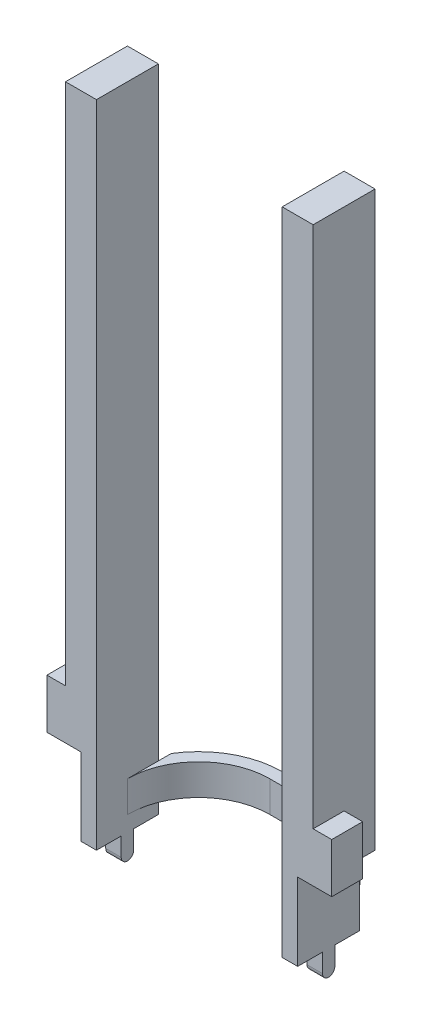
ISO-10303-21;
HEADER;
FILE_DESCRIPTION(('STEP AP214'),'2;1');
FILE_NAME('part.step','',(''),(''),'','','');
FILE_SCHEMA(('AUTOMOTIVE_DESIGN { 1 0 10303 214 1 1 1 1 }'));
ENDSEC;
DATA;
#1=APPLICATION_CONTEXT('core data for automotive mechanical design processes');
#2=APPLICATION_PROTOCOL_DEFINITION('international standard','automotive_design',2000,#1);
#3=PRODUCT_CONTEXT('',#1,'mechanical');
#4=PRODUCT('Part','Part','',(#3));
#5=PRODUCT_RELATED_PRODUCT_CATEGORY('part','',(#4));
#6=PRODUCT_DEFINITION_FORMATION('','',#4);
#7=PRODUCT_DEFINITION_CONTEXT('part definition',#1,'design');
#8=PRODUCT_DEFINITION('design','',#6,#7);
#9=PRODUCT_DEFINITION_SHAPE('','',#8);
#10=(LENGTH_UNIT() NAMED_UNIT(*) SI_UNIT(.MILLI.,.METRE.));
#11=(NAMED_UNIT(*) PLANE_ANGLE_UNIT() SI_UNIT($,.RADIAN.));
#12=(NAMED_UNIT(*) SI_UNIT($,.STERADIAN.) SOLID_ANGLE_UNIT());
#13=UNCERTAINTY_MEASURE_WITH_UNIT(LENGTH_MEASURE(1.E-05),#10,'distance_accuracy_value','');
#14=(GEOMETRIC_REPRESENTATION_CONTEXT(3) GLOBAL_UNCERTAINTY_ASSIGNED_CONTEXT((#13)) GLOBAL_UNIT_ASSIGNED_CONTEXT((#10,
#11,#12)) REPRESENTATION_CONTEXT('',''));
#15=CARTESIAN_POINT('',(0.,0.,0.));
#16=DIRECTION('',(0.,0.,1.));
#17=DIRECTION('',(1.,0.,0.));
#18=AXIS2_PLACEMENT_3D('',#15,#16,#17);
#19=CARTESIAN_POINT('',(40.,25.,-10.));
#20=DIRECTION('',(-1.,0.,0.));
#21=DIRECTION('',(0.,0.,1.));
#22=AXIS2_PLACEMENT_3D('',#19,#20,#21);
#23=PLANE('',#22);
#24=DIRECTION('',(0.,0.,1.));
#25=VECTOR('',#24,1.);
#26=CARTESIAN_POINT('',(40.,36.,0.));
#27=LINE('',#26,#25);
#28=CARTESIAN_POINT('',(40.,36.,0.));
#29=VERTEX_POINT('',#28);
#30=CARTESIAN_POINT('',(40.,36.,9.99999999999999));
#31=VERTEX_POINT('',#30);
#32=EDGE_CURVE('E320',#29,#31,#27,.T.);
#33=ORIENTED_EDGE('',*,*,#32,.F.);
#34=DIRECTION('',(0.,-1.,0.));
#35=VECTOR('',#34,1.);
#36=CARTESIAN_POINT('',(40.,20.,0.));
#37=LINE('',#36,#35);
#38=CARTESIAN_POINT('',(40.,20.,0.));
#39=VERTEX_POINT('',#38);
#40=EDGE_CURVE('E305',#29,#39,#37,.T.);
#41=ORIENTED_EDGE('',*,*,#40,.T.);
#42=DIRECTION('',(0.,0.,1.));
#43=VECTOR('',#42,1.);
#44=CARTESIAN_POINT('',(40.,20.,10.));
#45=LINE('',#44,#43);
#46=CARTESIAN_POINT('',(40.,20.,-10.));
#47=VERTEX_POINT('',#46);
#48=EDGE_CURVE('E322',#47,#39,#45,.T.);
#49=ORIENTED_EDGE('',*,*,#48,.F.);
#50=DIRECTION('',(0.,-1.,0.));
#51=VECTOR('',#50,1.);
#52=CARTESIAN_POINT('',(40.,25.,-10.));
#53=LINE('',#52,#51);
#54=CARTESIAN_POINT('',(40.,205.,-10.));
#55=VERTEX_POINT('',#54);
#56=EDGE_CURVE('E471',#55,#47,#53,.T.);
#57=ORIENTED_EDGE('',*,*,#56,.F.);
#58=DIRECTION('',(0.,0.,-1.));
#59=VECTOR('',#58,1.);
#60=CARTESIAN_POINT('',(40.,205.,-10.));
#61=LINE('',#60,#59);
#62=CARTESIAN_POINT('',(40.,205.,10.));
#63=VERTEX_POINT('',#62);
#64=EDGE_CURVE('E401',#63,#55,#61,.T.);
#65=ORIENTED_EDGE('',*,*,#64,.F.);
#66=DIRECTION('',(0.,-1.,0.));
#67=VECTOR('',#66,1.);
#68=CARTESIAN_POINT('',(40.,25.,10.));
#69=LINE('',#68,#67);
#70=EDGE_CURVE('E474',#63,#31,#69,.T.);
#71=ORIENTED_EDGE('',*,*,#70,.T.);
#72=EDGE_LOOP('',(#33,#41,#49,#57,#65,#71));
#73=FACE_BOUND('',#72,.T.);
#74=ADVANCED_FACE('F38',(#73),#23,.F.);
#75=CARTESIAN_POINT('',(-40.,25.,-9.99999999999999));
#76=DIRECTION('',(1.,0.,0.));
#77=DIRECTION('',(0.,0.,-1.));
#78=AXIS2_PLACEMENT_3D('',#75,#76,#77);
#79=PLANE('',#78);
#80=DIRECTION('',(0.,0.,-1.));
#81=VECTOR('',#80,1.);
#82=CARTESIAN_POINT('',(-40.,20.,10.));
#83=LINE('',#82,#81);
#84=CARTESIAN_POINT('',(-40.,20.,0.));
#85=VERTEX_POINT('',#84);
#86=CARTESIAN_POINT('',(-40.,20.,-9.99999999999999));
#87=VERTEX_POINT('',#86);
#88=EDGE_CURVE('E291',#85,#87,#83,.T.);
#89=ORIENTED_EDGE('',*,*,#88,.F.);
#90=DIRECTION('',(0.,1.,0.));
#91=VECTOR('',#90,1.);
#92=CARTESIAN_POINT('',(-40.,20.,0.));
#93=LINE('',#92,#91);
#94=CARTESIAN_POINT('',(-40.,36.,0.));
#95=VERTEX_POINT('',#94);
#96=EDGE_CURVE('E283',#85,#95,#93,.T.);
#97=ORIENTED_EDGE('',*,*,#96,.T.);
#98=DIRECTION('',(0.,0.,1.));
#99=VECTOR('',#98,1.);
#100=CARTESIAN_POINT('',(-40.,36.,0.));
#101=LINE('',#100,#99);
#102=CARTESIAN_POINT('',(-40.,36.,10.));
#103=VERTEX_POINT('',#102);
#104=EDGE_CURVE('E269',#95,#103,#101,.T.);
#105=ORIENTED_EDGE('',*,*,#104,.T.);
#106=DIRECTION('',(0.,-1.,0.));
#107=VECTOR('',#106,1.);
#108=CARTESIAN_POINT('',(-40.,25.,10.));
#109=LINE('',#108,#107);
#110=CARTESIAN_POINT('',(-40.,205.,10.));
#111=VERTEX_POINT('',#110);
#112=EDGE_CURVE('E498',#111,#103,#109,.T.);
#113=ORIENTED_EDGE('',*,*,#112,.F.);
#114=DIRECTION('',(0.,0.,1.));
#115=VECTOR('',#114,1.);
#116=CARTESIAN_POINT('',(-40.,205.,-9.99999999999999));
#117=LINE('',#116,#115);
#118=CARTESIAN_POINT('',(-40.,205.,-9.99999999999999));
#119=VERTEX_POINT('',#118);
#120=EDGE_CURVE('E406',#119,#111,#117,.T.);
#121=ORIENTED_EDGE('',*,*,#120,.F.);
#122=DIRECTION('',(0.,-1.,0.));
#123=VECTOR('',#122,1.);
#124=CARTESIAN_POINT('',(-40.,25.,-9.99999999999999));
#125=LINE('',#124,#123);
#126=EDGE_CURVE('E500',#119,#87,#125,.T.);
#127=ORIENTED_EDGE('',*,*,#126,.T.);
#128=EDGE_LOOP('',(#89,#97,#105,#113,#121,#127));
#129=FACE_BOUND('',#128,.T.);
#130=ADVANCED_FACE('F289',(#129),#79,.F.);
#131=CARTESIAN_POINT('',(0.,-5.,0.));
#132=DIRECTION('',(0.,-1.,0.));
#133=DIRECTION('',(0.,0.,-1.));
#134=AXIS2_PLACEMENT_3D('',#131,#132,#133);
#135=PLANE('',#134);
#136=DIRECTION('',(0.,0.,1.));
#137=VECTOR('',#136,1.);
#138=CARTESIAN_POINT('',(-35.,-5.,0.));
#139=LINE('',#138,#137);
#140=CARTESIAN_POINT('',(-35.,-5.,-9.99999999999999));
#141=VERTEX_POINT('',#140);
#142=CARTESIAN_POINT('',(-35.,-5.,-2.));
#143=VERTEX_POINT('',#142);
#144=EDGE_CURVE('E362',#141,#143,#139,.T.);
#145=ORIENTED_EDGE('',*,*,#144,.F.);
#146=DIRECTION('',(-1.,0.,0.));
#147=VECTOR('',#146,1.);
#148=CARTESIAN_POINT('',(-30.,-5.,-10.));
#149=LINE('',#148,#147);
#150=CARTESIAN_POINT('',(-30.,-5.,-10.));
#151=VERTEX_POINT('',#150);
#152=EDGE_CURVE('E490',#151,#141,#149,.T.);
#153=ORIENTED_EDGE('',*,*,#152,.F.);
#154=DIRECTION('',(0.,0.,-1.));
#155=VECTOR('',#154,1.);
#156=CARTESIAN_POINT('',(-30.,-5.,-10.));
#157=LINE('',#156,#155);
#158=CARTESIAN_POINT('',(-30.,-5.,-2.));
#159=VERTEX_POINT('',#158);
#160=EDGE_CURVE('E486',#159,#151,#157,.T.);
#161=ORIENTED_EDGE('',*,*,#160,.F.);
#162=DIRECTION('',(-1.,0.,0.));
#163=VECTOR('',#162,1.);
#164=CARTESIAN_POINT('',(-30.,-5.,-2.));
#165=LINE('',#164,#163);
#166=EDGE_CURVE('E427',#159,#143,#165,.T.);
#167=ORIENTED_EDGE('',*,*,#166,.T.);
#168=EDGE_LOOP('',(#145,#153,#161,#167));
#169=FACE_BOUND('',#168,.T.);
#170=ADVANCED_FACE('F578',(#169),#135,.T.);
#171=CARTESIAN_POINT('',(0.,-5.,0.));
#172=DIRECTION('',(0.,1.,0.));
#173=DIRECTION('',(0.,0.,1.));
#174=AXIS2_PLACEMENT_3D('',#171,#172,#173);
#175=PLANE('',#174);
#176=DIRECTION('',(-1.,0.,0.));
#177=VECTOR('',#176,1.);
#178=CARTESIAN_POINT('',(30.,-5.,-10.));
#179=LINE('',#178,#177);
#180=CARTESIAN_POINT('',(35.,-5.,-10.));
#181=VERTEX_POINT('',#180);
#182=CARTESIAN_POINT('',(30.,-5.,-10.));
#183=VERTEX_POINT('',#182);
#184=EDGE_CURVE('E465',#181,#183,#179,.T.);
#185=ORIENTED_EDGE('',*,*,#184,.F.);
#186=DIRECTION('',(0.,0.,1.));
#187=VECTOR('',#186,1.);
#188=CARTESIAN_POINT('',(35.,-5.,0.));
#189=LINE('',#188,#187);
#190=CARTESIAN_POINT('',(35.,-5.,-2.));
#191=VERTEX_POINT('',#190);
#192=EDGE_CURVE('E371',#181,#191,#189,.T.);
#193=ORIENTED_EDGE('',*,*,#192,.T.);
#194=DIRECTION('',(1.,0.,0.));
#195=VECTOR('',#194,1.);
#196=CARTESIAN_POINT('',(30.,-5.,-2.));
#197=LINE('',#196,#195);
#198=CARTESIAN_POINT('',(30.,-5.,-2.));
#199=VERTEX_POINT('',#198);
#200=EDGE_CURVE('E451',#199,#191,#197,.T.);
#201=ORIENTED_EDGE('',*,*,#200,.F.);
#202=DIRECTION('',(0.,0.,1.));
#203=VECTOR('',#202,1.);
#204=CARTESIAN_POINT('',(30.,-5.,-10.));
#205=LINE('',#204,#203);
#206=EDGE_CURVE('E459',#183,#199,#205,.T.);
#207=ORIENTED_EDGE('',*,*,#206,.F.);
#208=EDGE_LOOP('',(#185,#193,#201,#207));
#209=FACE_BOUND('',#208,.T.);
#210=ADVANCED_FACE('F674',(#209),#175,.F.);
#211=CARTESIAN_POINT('',(-7.,10.,0.));
#212=DIRECTION('',(0.,1.,0.));
#213=DIRECTION('',(0.,0.,1.));
#214=AXIS2_PLACEMENT_3D('',#211,#212,#213);
#215=PLANE('',#214);
#216=DIRECTION('',(0.,0.,-1.));
#217=VECTOR('',#216,1.);
#218=CARTESIAN_POINT('',(-30.,10.,0.));
#219=LINE('',#218,#217);
#220=CARTESIAN_POINT('',(-30.,10.,-10.));
#221=VERTEX_POINT('',#220);
#222=CARTESIAN_POINT('',(-30.,10.,-14.142135623731));
#223=VERTEX_POINT('',#222);
#224=EDGE_CURVE('E393',#221,#223,#219,.T.);
#225=ORIENTED_EDGE('',*,*,#224,.F.);
#226=DIRECTION('',(0.,0.,1.));
#227=VECTOR('',#226,1.);
#228=CARTESIAN_POINT('',(-30.,10.,0.));
#229=LINE('',#228,#227);
#230=CARTESIAN_POINT('',(-30.,10.,0.));
#231=VERTEX_POINT('',#230);
#232=EDGE_CURVE('E506',#221,#231,#229,.T.);
#233=ORIENTED_EDGE('',*,*,#232,.T.);
#234=CARTESIAN_POINT('',(-7.,10.,0.));
#235=DIRECTION('',(0.,-1.,0.));
#236=DIRECTION('',(0.,0.,1.));
#237=AXIS2_PLACEMENT_3D('',#234,#235,#236);
#238=CIRCLE('',#237,23.);
#239=CARTESIAN_POINT('',(-7.,10.,-23.));
#240=VERTEX_POINT('',#239);
#241=EDGE_CURVE('E509',#231,#240,#238,.T.);
#242=ORIENTED_EDGE('',*,*,#241,.T.);
#243=DIRECTION('',(1.,0.,0.));
#244=VECTOR('',#243,1.);
#245=CARTESIAN_POINT('',(-7.,10.,-23.));
#246=LINE('',#245,#244);
#247=CARTESIAN_POINT('',(6.99999999999999,10.,-23.));
#248=VERTEX_POINT('',#247);
#249=EDGE_CURVE('E512',#240,#248,#246,.T.);
#250=ORIENTED_EDGE('',*,*,#249,.T.);
#251=CARTESIAN_POINT('',(7.,10.,0.));
#252=DIRECTION('',(0.,-1.,0.));
#253=DIRECTION('',(0.,0.,1.));
#254=AXIS2_PLACEMENT_3D('',#251,#252,#253);
#255=CIRCLE('',#254,23.);
#256=CARTESIAN_POINT('',(30.,10.,0.));
#257=VERTEX_POINT('',#256);
#258=EDGE_CURVE('E515',#248,#257,#255,.T.);
#259=ORIENTED_EDGE('',*,*,#258,.T.);
#260=DIRECTION('',(0.,0.,-1.));
#261=VECTOR('',#260,1.);
#262=CARTESIAN_POINT('',(30.,10.,0.));
#263=LINE('',#262,#261);
#264=CARTESIAN_POINT('',(30.,10.,-10.));
#265=VERTEX_POINT('',#264);
#266=EDGE_CURVE('E483',#257,#265,#263,.T.);
#267=ORIENTED_EDGE('',*,*,#266,.T.);
#268=DIRECTION('',(0.,0.,1.));
#269=VECTOR('',#268,1.);
#270=CARTESIAN_POINT('',(30.,10.,0.));
#271=LINE('',#270,#269);
#272=CARTESIAN_POINT('',(30.,10.,-14.142135623731));
#273=VERTEX_POINT('',#272);
#274=EDGE_CURVE('E385',#273,#265,#271,.T.);
#275=ORIENTED_EDGE('',*,*,#274,.F.);
#276=CARTESIAN_POINT('',(7.,10.,0.));
#277=DIRECTION('',(0.,1.,0.));
#278=DIRECTION('',(0.,0.,1.));
#279=AXIS2_PLACEMENT_3D('',#276,#277,#278);
#280=CIRCLE('',#279,27.);
#281=CARTESIAN_POINT('',(7.,10.,-27.));
#282=VERTEX_POINT('',#281);
#283=EDGE_CURVE('E517',#273,#282,#280,.T.);
#284=ORIENTED_EDGE('',*,*,#283,.T.);
#285=DIRECTION('',(-1.,0.,0.));
#286=VECTOR('',#285,1.);
#287=CARTESIAN_POINT('',(-7.00000000000001,10.,-27.));
#288=LINE('',#287,#286);
#289=CARTESIAN_POINT('',(-7.00000000000001,10.,-27.));
#290=VERTEX_POINT('',#289);
#291=EDGE_CURVE('E519',#282,#290,#288,.T.);
#292=ORIENTED_EDGE('',*,*,#291,.T.);
#293=CARTESIAN_POINT('',(-7.,10.,0.));
#294=DIRECTION('',(0.,1.,0.));
#295=DIRECTION('',(0.,0.,1.));
#296=AXIS2_PLACEMENT_3D('',#293,#294,#295);
#297=CIRCLE('',#296,27.);
#298=EDGE_CURVE('E521',#290,#223,#297,.T.);
#299=ORIENTED_EDGE('',*,*,#298,.T.);
#300=EDGE_LOOP('',(#225,#233,#242,#250,#259,#267,#275,#284,#292,#299));
#301=FACE_BOUND('',#300,.T.);
#302=ADVANCED_FACE('F598',(#301),#215,.T.);
#303=CARTESIAN_POINT('',(-7.,0.,0.));
#304=DIRECTION('',(0.,1.,0.));
#305=DIRECTION('',(0.,0.,1.));
#306=AXIS2_PLACEMENT_3D('',#303,#304,#305);
#307=PLANE('',#306);
#308=DIRECTION('',(0.,0.,1.));
#309=VECTOR('',#308,1.);
#310=CARTESIAN_POINT('',(-30.,0.,0.));
#311=LINE('',#310,#309);
#312=CARTESIAN_POINT('',(-30.,0.,-10.));
#313=VERTEX_POINT('',#312);
#314=CARTESIAN_POINT('',(-30.,0.,0.));
#315=VERTEX_POINT('',#314);
#316=EDGE_CURVE('E554',#313,#315,#311,.T.);
#317=ORIENTED_EDGE('',*,*,#316,.F.);
#318=DIRECTION('',(0.,0.,-1.));
#319=VECTOR('',#318,1.);
#320=CARTESIAN_POINT('',(-30.,0.,0.));
#321=LINE('',#320,#319);
#322=CARTESIAN_POINT('',(-30.,0.,-14.142135623731));
#323=VERTEX_POINT('',#322);
#324=EDGE_CURVE('E390',#313,#323,#321,.T.);
#325=ORIENTED_EDGE('',*,*,#324,.T.);
#326=CARTESIAN_POINT('',(-7.,0.,0.));
#327=DIRECTION('',(0.,1.,0.));
#328=DIRECTION('',(0.,0.,1.));
#329=AXIS2_PLACEMENT_3D('',#326,#327,#328);
#330=CIRCLE('',#329,27.);
#331=CARTESIAN_POINT('',(-7.00000000000001,0.,-27.));
#332=VERTEX_POINT('',#331);
#333=EDGE_CURVE('E513',#332,#323,#330,.T.);
#334=ORIENTED_EDGE('',*,*,#333,.F.);
#335=DIRECTION('',(-1.,0.,0.));
#336=VECTOR('',#335,1.);
#337=CARTESIAN_POINT('',(-7.00000000000001,0.,-27.));
#338=LINE('',#337,#336);
#339=CARTESIAN_POINT('',(7.,0.,-27.));
#340=VERTEX_POINT('',#339);
#341=EDGE_CURVE('E534',#340,#332,#338,.T.);
#342=ORIENTED_EDGE('',*,*,#341,.F.);
#343=CARTESIAN_POINT('',(7.,0.,0.));
#344=DIRECTION('',(0.,1.,0.));
#345=DIRECTION('',(0.,0.,1.));
#346=AXIS2_PLACEMENT_3D('',#343,#344,#345);
#347=CIRCLE('',#346,27.);
#348=CARTESIAN_POINT('',(30.,0.,-14.142135623731));
#349=VERTEX_POINT('',#348);
#350=EDGE_CURVE('E532',#349,#340,#347,.T.);
#351=ORIENTED_EDGE('',*,*,#350,.F.);
#352=DIRECTION('',(0.,0.,1.));
#353=VECTOR('',#352,1.);
#354=CARTESIAN_POINT('',(30.,0.,0.));
#355=LINE('',#354,#353);
#356=CARTESIAN_POINT('',(30.,0.,-10.));
#357=VERTEX_POINT('',#356);
#358=EDGE_CURVE('E382',#349,#357,#355,.T.);
#359=ORIENTED_EDGE('',*,*,#358,.T.);
#360=DIRECTION('',(0.,0.,-1.));
#361=VECTOR('',#360,1.);
#362=CARTESIAN_POINT('',(30.,0.,0.));
#363=LINE('',#362,#361);
#364=CARTESIAN_POINT('',(30.,0.,0.));
#365=VERTEX_POINT('',#364);
#366=EDGE_CURVE('E480',#365,#357,#363,.T.);
#367=ORIENTED_EDGE('',*,*,#366,.F.);
#368=CARTESIAN_POINT('',(7.,0.,0.));
#369=DIRECTION('',(0.,-1.,0.));
#370=DIRECTION('',(0.,0.,1.));
#371=AXIS2_PLACEMENT_3D('',#368,#369,#370);
#372=CIRCLE('',#371,23.);
#373=CARTESIAN_POINT('',(6.99999999999999,0.,-23.));
#374=VERTEX_POINT('',#373);
#375=EDGE_CURVE('E529',#374,#365,#372,.T.);
#376=ORIENTED_EDGE('',*,*,#375,.F.);
#377=DIRECTION('',(1.,0.,0.));
#378=VECTOR('',#377,1.);
#379=CARTESIAN_POINT('',(-7.,0.,-23.));
#380=LINE('',#379,#378);
#381=CARTESIAN_POINT('',(-7.,0.,-23.));
#382=VERTEX_POINT('',#381);
#383=EDGE_CURVE('E527',#382,#374,#380,.T.);
#384=ORIENTED_EDGE('',*,*,#383,.F.);
#385=CARTESIAN_POINT('',(-7.,0.,0.));
#386=DIRECTION('',(0.,-1.,0.));
#387=DIRECTION('',(0.,0.,1.));
#388=AXIS2_PLACEMENT_3D('',#385,#386,#387);
#389=CIRCLE('',#388,23.);
#390=EDGE_CURVE('E508',#315,#382,#389,.T.);
#391=ORIENTED_EDGE('',*,*,#390,.F.);
#392=EDGE_LOOP('',(#317,#325,#334,#342,#351,#359,#367,#376,#384,#391));
#393=FACE_BOUND('',#392,.T.);
#394=ADVANCED_FACE('F591',(#393),#307,.F.);
#395=CARTESIAN_POINT('',(7.,10.,0.));
#396=DIRECTION('',(0.,-1.,0.));
#397=DIRECTION('',(0.,0.,-1.));
#398=AXIS2_PLACEMENT_3D('',#395,#396,#397);
#399=CYLINDRICAL_SURFACE('',#398,27.);
#400=ORIENTED_EDGE('',*,*,#283,.F.);
#401=DIRECTION('',(0.,-1.,0.));
#402=VECTOR('',#401,1.);
#403=CARTESIAN_POINT('',(30.,10.,-14.142135623731));
#404=LINE('',#403,#402);
#405=EDGE_CURVE('E378',#273,#349,#404,.T.);
#406=ORIENTED_EDGE('',*,*,#405,.T.);
#407=ORIENTED_EDGE('',*,*,#350,.T.);
#408=DIRECTION('',(0.,-1.,0.));
#409=VECTOR('',#408,1.);
#410=CARTESIAN_POINT('',(7.,10.,-27.));
#411=LINE('',#410,#409);
#412=EDGE_CURVE('E542',#282,#340,#411,.T.);
#413=ORIENTED_EDGE('',*,*,#412,.F.);
#414=EDGE_LOOP('',(#400,#406,#407,#413));
#415=FACE_BOUND('',#414,.T.);
#416=ADVANCED_FACE('F613',(#415),#399,.T.);
#417=CARTESIAN_POINT('',(-7.,10.,0.));
#418=DIRECTION('',(0.,-1.,0.));
#419=DIRECTION('',(0.,0.,-1.));
#420=AXIS2_PLACEMENT_3D('',#417,#418,#419);
#421=CYLINDRICAL_SURFACE('',#420,27.);
#422=ORIENTED_EDGE('',*,*,#333,.T.);
#423=DIRECTION('',(0.,-1.,0.));
#424=VECTOR('',#423,1.);
#425=CARTESIAN_POINT('',(-30.,10.,-14.142135623731));
#426=LINE('',#425,#424);
#427=EDGE_CURVE('E387',#323,#223,#426,.F.);
#428=ORIENTED_EDGE('',*,*,#427,.T.);
#429=ORIENTED_EDGE('',*,*,#298,.F.);
#430=DIRECTION('',(0.,-1.,0.));
#431=VECTOR('',#430,1.);
#432=CARTESIAN_POINT('',(-7.00000000000001,10.,-27.));
#433=LINE('',#432,#431);
#434=EDGE_CURVE('E539',#290,#332,#433,.T.);
#435=ORIENTED_EDGE('',*,*,#434,.T.);
#436=EDGE_LOOP('',(#422,#428,#429,#435));
#437=FACE_BOUND('',#436,.T.);
#438=ADVANCED_FACE('F603',(#437),#421,.T.);
#439=CARTESIAN_POINT('',(-7.,10.,0.));
#440=DIRECTION('',(0.,-1.,0.));
#441=DIRECTION('',(0.,0.,-1.));
#442=AXIS2_PLACEMENT_3D('',#439,#440,#441);
#443=CYLINDRICAL_SURFACE('',#442,23.);
#444=ORIENTED_EDGE('',*,*,#390,.T.);
#445=DIRECTION('',(0.,-1.,0.));
#446=VECTOR('',#445,1.);
#447=CARTESIAN_POINT('',(-7.,10.,-23.));
#448=LINE('',#447,#446);
#449=EDGE_CURVE('E551',#240,#382,#448,.T.);
#450=ORIENTED_EDGE('',*,*,#449,.F.);
#451=ORIENTED_EDGE('',*,*,#241,.F.);
#452=DIRECTION('',(0.,-1.,0.));
#453=VECTOR('',#452,1.);
#454=CARTESIAN_POINT('',(-30.,10.,0.));
#455=LINE('',#454,#453);
#456=EDGE_CURVE('E524',#231,#315,#455,.T.);
#457=ORIENTED_EDGE('',*,*,#456,.T.);
#458=EDGE_LOOP('',(#444,#450,#451,#457));
#459=FACE_BOUND('',#458,.T.);
#460=ADVANCED_FACE('F40',(#459),#443,.F.);
#461=CARTESIAN_POINT('',(-7.,10.,-23.));
#462=DIRECTION('',(0.,0.,-1.));
#463=DIRECTION('',(-1.,0.,0.));
#464=AXIS2_PLACEMENT_3D('',#461,#462,#463);
#465=PLANE('',#464);
#466=ORIENTED_EDGE('',*,*,#383,.T.);
#467=DIRECTION('',(0.,-1.,0.));
#468=VECTOR('',#467,1.);
#469=CARTESIAN_POINT('',(6.99999999999999,10.,-23.));
#470=LINE('',#469,#468);
#471=EDGE_CURVE('E548',#248,#374,#470,.T.);
#472=ORIENTED_EDGE('',*,*,#471,.F.);
#473=ORIENTED_EDGE('',*,*,#249,.F.);
#474=ORIENTED_EDGE('',*,*,#449,.T.);
#475=EDGE_LOOP('',(#466,#472,#473,#474));
#476=FACE_BOUND('',#475,.T.);
#477=ADVANCED_FACE('F636',(#476),#465,.F.);
#478=CARTESIAN_POINT('',(7.,10.,0.));
#479=DIRECTION('',(0.,-1.,0.));
#480=DIRECTION('',(0.,0.,-1.));
#481=AXIS2_PLACEMENT_3D('',#478,#479,#480);
#482=CYLINDRICAL_SURFACE('',#481,23.);
#483=ORIENTED_EDGE('',*,*,#375,.T.);
#484=DIRECTION('',(0.,-1.,0.));
#485=VECTOR('',#484,1.);
#486=CARTESIAN_POINT('',(30.,10.,0.));
#487=LINE('',#486,#485);
#488=EDGE_CURVE('E545',#257,#365,#487,.T.);
#489=ORIENTED_EDGE('',*,*,#488,.F.);
#490=ORIENTED_EDGE('',*,*,#258,.F.);
#491=ORIENTED_EDGE('',*,*,#471,.T.);
#492=EDGE_LOOP('',(#483,#489,#490,#491));
#493=FACE_BOUND('',#492,.T.);
#494=ADVANCED_FACE('F634',(#493),#482,.F.);
#495=CARTESIAN_POINT('',(-7.00000000000001,10.,-27.));
#496=DIRECTION('',(0.,0.,1.));
#497=DIRECTION('',(1.,0.,0.));
#498=AXIS2_PLACEMENT_3D('',#495,#496,#497);
#499=PLANE('',#498);
#500=ORIENTED_EDGE('',*,*,#341,.T.);
#501=ORIENTED_EDGE('',*,*,#434,.F.);
#502=ORIENTED_EDGE('',*,*,#291,.F.);
#503=ORIENTED_EDGE('',*,*,#412,.T.);
#504=EDGE_LOOP('',(#500,#501,#502,#503));
#505=FACE_BOUND('',#504,.T.);
#506=ADVANCED_FACE('F608',(#505),#499,.F.);
#507=CARTESIAN_POINT('',(-30.,25.,-10.));
#508=DIRECTION('',(-1.,0.,0.));
#509=DIRECTION('',(0.,0.,1.));
#510=AXIS2_PLACEMENT_3D('',#507,#508,#509);
#511=PLANE('',#510);
#512=ORIENTED_EDGE('',*,*,#232,.F.);
#513=DIRECTION('',(0.,-1.,0.));
#514=VECTOR('',#513,1.);
#515=CARTESIAN_POINT('',(-30.,25.,-10.));
#516=LINE('',#515,#514);
#517=CARTESIAN_POINT('',(-30.,205.,-9.99999999999999));
#518=VERTEX_POINT('',#517);
#519=EDGE_CURVE('E503',#518,#221,#516,.T.);
#520=ORIENTED_EDGE('',*,*,#519,.F.);
#521=DIRECTION('',(0.,0.,-1.));
#522=VECTOR('',#521,1.);
#523=CARTESIAN_POINT('',(-30.,205.,-9.99999999999999));
#524=LINE('',#523,#522);
#525=CARTESIAN_POINT('',(-30.,205.,10.));
#526=VERTEX_POINT('',#525);
#527=EDGE_CURVE('E412',#526,#518,#524,.T.);
#528=ORIENTED_EDGE('',*,*,#527,.F.);
#529=DIRECTION('',(0.,-1.,0.));
#530=VECTOR('',#529,1.);
#531=CARTESIAN_POINT('',(-30.,25.,10.));
#532=LINE('',#531,#530);
#533=CARTESIAN_POINT('',(-30.,-5.,10.));
#534=VERTEX_POINT('',#533);
#535=EDGE_CURVE('E495',#526,#534,#532,.T.);
#536=ORIENTED_EDGE('',*,*,#535,.T.);
#537=CARTESIAN_POINT('',(-30.,-5.,2.));
#538=VERTEX_POINT('',#537);
#539=EDGE_CURVE('E487',#534,#538,#157,.T.);
#540=ORIENTED_EDGE('',*,*,#539,.T.);
#541=DIRECTION('',(0.,1.,0.));
#542=VECTOR('',#541,1.);
#543=CARTESIAN_POINT('',(-30.,-5.,2.));
#544=LINE('',#543,#542);
#545=CARTESIAN_POINT('',(-30.,-11.,2.));
#546=VERTEX_POINT('',#545);
#547=EDGE_CURVE('E424',#546,#538,#544,.T.);
#548=ORIENTED_EDGE('',*,*,#547,.F.);
#549=CARTESIAN_POINT('',(-30.,-11.,0.));
#550=DIRECTION('',(-1.,0.,0.));
#551=DIRECTION('',(0.,0.,1.));
#552=AXIS2_PLACEMENT_3D('',#549,#550,#551);
#553=CIRCLE('',#552,2.);
#554=CARTESIAN_POINT('',(-30.,-11.,-2.));
#555=VERTEX_POINT('',#554);
#556=EDGE_CURVE('E421',#555,#546,#553,.T.);
#557=ORIENTED_EDGE('',*,*,#556,.F.);
#558=DIRECTION('',(0.,-1.,0.));
#559=VECTOR('',#558,1.);
#560=CARTESIAN_POINT('',(-30.,-5.,-2.));
#561=LINE('',#560,#559);
#562=EDGE_CURVE('E418',#159,#555,#561,.T.);
#563=ORIENTED_EDGE('',*,*,#562,.F.);
#564=ORIENTED_EDGE('',*,*,#160,.T.);
#565=EDGE_CURVE('E502',#313,#151,#516,.T.);
#566=ORIENTED_EDGE('',*,*,#565,.F.);
#567=ORIENTED_EDGE('',*,*,#316,.T.);
#568=ORIENTED_EDGE('',*,*,#456,.F.);
#569=EDGE_LOOP('',(#512,#520,#528,#536,#540,#548,#557,#563,#564,#566,#567,#568));
#570=FACE_BOUND('',#569,.T.);
#571=ADVANCED_FACE('F572',(#570),#511,.F.);
#572=CARTESIAN_POINT('',(-30.,25.,-10.));
#573=DIRECTION('',(0.,0.,1.));
#574=DIRECTION('',(1.,0.,0.));
#575=AXIS2_PLACEMENT_3D('',#572,#573,#574);
#576=PLANE('',#575);
#577=ORIENTED_EDGE('',*,*,#152,.T.);
#578=DIRECTION('',(0.,-1.,0.));
#579=VECTOR('',#578,1.);
#580=CARTESIAN_POINT('',(-35.,20.,-9.99999999999999));
#581=LINE('',#580,#579);
#582=CARTESIAN_POINT('',(-35.,20.,-9.99999999999999));
#583=VERTEX_POINT('',#582);
#584=EDGE_CURVE('E337',#583,#141,#581,.T.);
#585=ORIENTED_EDGE('',*,*,#584,.F.);
#586=DIRECTION('',(1.,0.,0.));
#587=VECTOR('',#586,1.);
#588=CARTESIAN_POINT('',(-40.,20.,-9.99999999999999));
#589=LINE('',#588,#587);
#590=EDGE_CURVE('E328',#87,#583,#589,.T.);
#591=ORIENTED_EDGE('',*,*,#590,.F.);
#592=ORIENTED_EDGE('',*,*,#126,.F.);
#593=DIRECTION('',(-1.,0.,0.));
#594=VECTOR('',#593,1.);
#595=CARTESIAN_POINT('',(-40.,205.,-9.99999999999999));
#596=LINE('',#595,#594);
#597=EDGE_CURVE('E415',#518,#119,#596,.T.);
#598=ORIENTED_EDGE('',*,*,#597,.F.);
#599=ORIENTED_EDGE('',*,*,#519,.T.);
#600=DIRECTION('',(0.,-1.,0.));
#601=VECTOR('',#600,1.);
#602=CARTESIAN_POINT('',(-30.,205.,-10.));
#603=LINE('',#602,#601);
#604=EDGE_CURVE('E375',#221,#313,#603,.T.);
#605=ORIENTED_EDGE('',*,*,#604,.T.);
#606=ORIENTED_EDGE('',*,*,#565,.T.);
#607=EDGE_LOOP('',(#577,#585,#591,#592,#598,#599,#605,#606));
#608=FACE_BOUND('',#607,.T.);
#609=ADVANCED_FACE('F583',(#608),#576,.F.);
#610=CARTESIAN_POINT('',(-30.,25.,10.));
#611=DIRECTION('',(0.,0.,-1.));
#612=DIRECTION('',(-1.,0.,0.));
#613=AXIS2_PLACEMENT_3D('',#610,#611,#612);
#614=PLANE('',#613);
#615=DIRECTION('',(-1.,0.,0.));
#616=VECTOR('',#615,1.);
#617=CARTESIAN_POINT('',(-40.,20.,10.));
#618=LINE('',#617,#616);
#619=CARTESIAN_POINT('',(-35.,20.,10.));
#620=VERTEX_POINT('',#619);
#621=CARTESIAN_POINT('',(-46.,20.,9.99999999999999));
#622=VERTEX_POINT('',#621);
#623=EDGE_CURVE('E335',#620,#622,#618,.T.);
#624=ORIENTED_EDGE('',*,*,#623,.F.);
#625=DIRECTION('',(0.,-1.,0.));
#626=VECTOR('',#625,1.);
#627=CARTESIAN_POINT('',(-35.,20.,10.));
#628=LINE('',#627,#626);
#629=CARTESIAN_POINT('',(-35.,-5.,10.));
#630=VERTEX_POINT('',#629);
#631=EDGE_CURVE('E338',#620,#630,#628,.T.);
#632=ORIENTED_EDGE('',*,*,#631,.T.);
#633=DIRECTION('',(1.,0.,0.));
#634=VECTOR('',#633,1.);
#635=CARTESIAN_POINT('',(-30.,-5.,10.));
#636=LINE('',#635,#634);
#637=EDGE_CURVE('E493',#630,#534,#636,.T.);
#638=ORIENTED_EDGE('',*,*,#637,.T.);
#639=ORIENTED_EDGE('',*,*,#535,.F.);
#640=DIRECTION('',(1.,0.,0.));
#641=VECTOR('',#640,1.);
#642=CARTESIAN_POINT('',(-40.,205.,10.));
#643=LINE('',#642,#641);
#644=EDGE_CURVE('E409',#111,#526,#643,.T.);
#645=ORIENTED_EDGE('',*,*,#644,.F.);
#646=ORIENTED_EDGE('',*,*,#112,.T.);
#647=DIRECTION('',(-1.,0.,0.));
#648=VECTOR('',#647,1.);
#649=CARTESIAN_POINT('',(-40.,36.,9.99999999999999));
#650=LINE('',#649,#648);
#651=CARTESIAN_POINT('',(-46.,36.,9.99999999999999));
#652=VERTEX_POINT('',#651);
#653=EDGE_CURVE('E53',#103,#652,#650,.T.);
#654=ORIENTED_EDGE('',*,*,#653,.T.);
#655=DIRECTION('',(0.,-1.,0.));
#656=VECTOR('',#655,1.);
#657=CARTESIAN_POINT('',(-46.,20.,9.99999999999999));
#658=LINE('',#657,#656);
#659=EDGE_CURVE('E292',#652,#622,#658,.T.);
#660=ORIENTED_EDGE('',*,*,#659,.T.);
#661=EDGE_LOOP('',(#624,#632,#638,#639,#645,#646,#654,#660));
#662=FACE_BOUND('',#661,.T.);
#663=ADVANCED_FACE('F663',(#662),#614,.F.);
#664=DIRECTION('',(0.,0.,1.));
#665=VECTOR('',#664,1.);
#666=CARTESIAN_POINT('',(-35.,-5.,0.));
#667=LINE('',#666,#665);
#668=CARTESIAN_POINT('',(-35.,-5.,2.));
#669=VERTEX_POINT('',#668);
#670=EDGE_CURVE('E360',#669,#630,#667,.T.);
#671=ORIENTED_EDGE('',*,*,#670,.F.);
#672=DIRECTION('',(-1.,0.,0.));
#673=VECTOR('',#672,1.);
#674=CARTESIAN_POINT('',(-30.,-5.,2.));
#675=LINE('',#674,#673);
#676=EDGE_CURVE('E431',#538,#669,#675,.T.);
#677=ORIENTED_EDGE('',*,*,#676,.F.);
#678=ORIENTED_EDGE('',*,*,#539,.F.);
#679=ORIENTED_EDGE('',*,*,#637,.F.);
#680=EDGE_LOOP('',(#671,#677,#678,#679));
#681=FACE_BOUND('',#680,.T.);
#682=ADVANCED_FACE('F660',(#681),#135,.T.);
#683=CARTESIAN_POINT('',(30.,25.,-10.));
#684=DIRECTION('',(1.,0.,0.));
#685=DIRECTION('',(0.,0.,-1.));
#686=AXIS2_PLACEMENT_3D('',#683,#684,#685);
#687=PLANE('',#686);
#688=ORIENTED_EDGE('',*,*,#266,.F.);
#689=ORIENTED_EDGE('',*,*,#488,.T.);
#690=ORIENTED_EDGE('',*,*,#366,.T.);
#691=DIRECTION('',(0.,-1.,0.));
#692=VECTOR('',#691,1.);
#693=CARTESIAN_POINT('',(30.,25.,-10.));
#694=LINE('',#693,#692);
#695=EDGE_CURVE('E467',#357,#183,#694,.T.);
#696=ORIENTED_EDGE('',*,*,#695,.T.);
#697=ORIENTED_EDGE('',*,*,#206,.T.);
#698=DIRECTION('',(0.,1.,0.));
#699=VECTOR('',#698,1.);
#700=CARTESIAN_POINT('',(30.,-5.,-2.));
#701=LINE('',#700,#699);
#702=CARTESIAN_POINT('',(30.,-11.,-2.));
#703=VERTEX_POINT('',#702);
#704=EDGE_CURVE('E444',#703,#199,#701,.T.);
#705=ORIENTED_EDGE('',*,*,#704,.F.);
#706=CARTESIAN_POINT('',(30.,-11.,0.));
#707=DIRECTION('',(1.,0.,0.));
#708=DIRECTION('',(0.,0.,-1.));
#709=AXIS2_PLACEMENT_3D('',#706,#707,#708);
#710=CIRCLE('',#709,2.);
#711=CARTESIAN_POINT('',(30.,-11.,2.));
#712=VERTEX_POINT('',#711);
#713=EDGE_CURVE('E441',#712,#703,#710,.T.);
#714=ORIENTED_EDGE('',*,*,#713,.F.);
#715=DIRECTION('',(0.,-1.,0.));
#716=VECTOR('',#715,1.);
#717=CARTESIAN_POINT('',(30.,-5.,2.));
#718=LINE('',#717,#716);
#719=CARTESIAN_POINT('',(30.,-5.,2.));
#720=VERTEX_POINT('',#719);
#721=EDGE_CURVE('E430',#720,#712,#718,.T.);
#722=ORIENTED_EDGE('',*,*,#721,.F.);
#723=CARTESIAN_POINT('',(30.,-5.,10.));
#724=VERTEX_POINT('',#723);
#725=EDGE_CURVE('E450',#720,#724,#205,.T.);
#726=ORIENTED_EDGE('',*,*,#725,.T.);
#727=DIRECTION('',(0.,-1.,0.));
#728=VECTOR('',#727,1.);
#729=CARTESIAN_POINT('',(30.,25.,10.));
#730=LINE('',#729,#728);
#731=CARTESIAN_POINT('',(30.,205.,10.));
#732=VERTEX_POINT('',#731);
#733=EDGE_CURVE('E477',#732,#724,#730,.T.);
#734=ORIENTED_EDGE('',*,*,#733,.F.);
#735=DIRECTION('',(0.,0.,1.));
#736=VECTOR('',#735,1.);
#737=CARTESIAN_POINT('',(30.,205.,-10.));
#738=LINE('',#737,#736);
#739=CARTESIAN_POINT('',(30.,205.,-10.));
#740=VERTEX_POINT('',#739);
#741=EDGE_CURVE('E395',#740,#732,#738,.T.);
#742=ORIENTED_EDGE('',*,*,#741,.F.);
#743=EDGE_CURVE('E468',#740,#265,#694,.T.);
#744=ORIENTED_EDGE('',*,*,#743,.T.);
#745=EDGE_LOOP('',(#688,#689,#690,#696,#697,#705,#714,#722,#726,#734,#742,#744));
#746=FACE_BOUND('',#745,.T.);
#747=ADVANCED_FACE('F624',(#746),#687,.F.);
#748=CARTESIAN_POINT('',(30.,25.,10.));
#749=DIRECTION('',(0.,0.,-1.));
#750=DIRECTION('',(-1.,0.,0.));
#751=AXIS2_PLACEMENT_3D('',#748,#749,#750);
#752=PLANE('',#751);
#753=DIRECTION('',(1.,0.,0.));
#754=VECTOR('',#753,1.);
#755=CARTESIAN_POINT('',(30.,-5.,10.));
#756=LINE('',#755,#754);
#757=CARTESIAN_POINT('',(35.,-5.,10.));
#758=VERTEX_POINT('',#757);
#759=EDGE_CURVE('E462',#724,#758,#756,.T.);
#760=ORIENTED_EDGE('',*,*,#759,.T.);
#761=DIRECTION('',(0.,-1.,0.));
#762=VECTOR('',#761,1.);
#763=CARTESIAN_POINT('',(35.,20.,10.));
#764=LINE('',#763,#762);
#765=CARTESIAN_POINT('',(35.,20.,10.));
#766=VERTEX_POINT('',#765);
#767=EDGE_CURVE('E353',#766,#758,#764,.T.);
#768=ORIENTED_EDGE('',*,*,#767,.F.);
#769=DIRECTION('',(-1.,0.,0.));
#770=VECTOR('',#769,1.);
#771=CARTESIAN_POINT('',(40.,20.,10.));
#772=LINE('',#771,#770);
#773=CARTESIAN_POINT('',(46.,20.,9.99999999999999));
#774=VERTEX_POINT('',#773);
#775=EDGE_CURVE('E345',#774,#766,#772,.T.);
#776=ORIENTED_EDGE('',*,*,#775,.F.);
#777=DIRECTION('',(0.,1.,0.));
#778=VECTOR('',#777,1.);
#779=CARTESIAN_POINT('',(46.,20.,9.99999999999999));
#780=LINE('',#779,#778);
#781=CARTESIAN_POINT('',(46.,36.,9.99999999999999));
#782=VERTEX_POINT('',#781);
#783=EDGE_CURVE('E303',#774,#782,#780,.T.);
#784=ORIENTED_EDGE('',*,*,#783,.T.);
#785=DIRECTION('',(-1.,0.,0.));
#786=VECTOR('',#785,1.);
#787=CARTESIAN_POINT('',(40.,36.,9.99999999999999));
#788=LINE('',#787,#786);
#789=EDGE_CURVE('E307',#782,#31,#788,.T.);
#790=ORIENTED_EDGE('',*,*,#789,.T.);
#791=ORIENTED_EDGE('',*,*,#70,.F.);
#792=DIRECTION('',(1.,0.,0.));
#793=VECTOR('',#792,1.);
#794=CARTESIAN_POINT('',(30.,205.,10.));
#795=LINE('',#794,#793);
#796=EDGE_CURVE('E398',#732,#63,#795,.T.);
#797=ORIENTED_EDGE('',*,*,#796,.F.);
#798=ORIENTED_EDGE('',*,*,#733,.T.);
#799=EDGE_LOOP('',(#760,#768,#776,#784,#790,#791,#797,#798));
#800=FACE_BOUND('',#799,.T.);
#801=ADVANCED_FACE('F654',(#800),#752,.F.);
#802=CARTESIAN_POINT('',(30.,25.,-10.));
#803=DIRECTION('',(0.,0.,1.));
#804=DIRECTION('',(1.,0.,0.));
#805=AXIS2_PLACEMENT_3D('',#802,#803,#804);
#806=PLANE('',#805);
#807=DIRECTION('',(1.,0.,0.));
#808=VECTOR('',#807,1.);
#809=CARTESIAN_POINT('',(40.,20.,-10.));
#810=LINE('',#809,#808);
#811=CARTESIAN_POINT('',(35.,20.,-10.));
#812=VERTEX_POINT('',#811);
#813=EDGE_CURVE('E351',#812,#47,#810,.T.);
#814=ORIENTED_EDGE('',*,*,#813,.F.);
#815=DIRECTION('',(0.,-1.,0.));
#816=VECTOR('',#815,1.);
#817=CARTESIAN_POINT('',(35.,20.,-10.));
#818=LINE('',#817,#816);
#819=EDGE_CURVE('E329',#812,#181,#818,.T.);
#820=ORIENTED_EDGE('',*,*,#819,.T.);
#821=ORIENTED_EDGE('',*,*,#184,.T.);
#822=ORIENTED_EDGE('',*,*,#695,.F.);
#823=DIRECTION('',(0.,-1.,0.));
#824=VECTOR('',#823,1.);
#825=CARTESIAN_POINT('',(30.,205.,-10.));
#826=LINE('',#825,#824);
#827=EDGE_CURVE('E374',#265,#357,#826,.T.);
#828=ORIENTED_EDGE('',*,*,#827,.F.);
#829=ORIENTED_EDGE('',*,*,#743,.F.);
#830=DIRECTION('',(-1.,0.,0.));
#831=VECTOR('',#830,1.);
#832=CARTESIAN_POINT('',(30.,205.,-10.));
#833=LINE('',#832,#831);
#834=EDGE_CURVE('E404',#55,#740,#833,.T.);
#835=ORIENTED_EDGE('',*,*,#834,.F.);
#836=ORIENTED_EDGE('',*,*,#56,.T.);
#837=EDGE_LOOP('',(#814,#820,#821,#822,#828,#829,#835,#836));
#838=FACE_BOUND('',#837,.T.);
#839=ADVANCED_FACE('F628',(#838),#806,.F.);
#840=DIRECTION('',(1.,0.,0.));
#841=VECTOR('',#840,1.);
#842=CARTESIAN_POINT('',(30.,-5.,2.));
#843=LINE('',#842,#841);
#844=CARTESIAN_POINT('',(35.,-5.,2.));
#845=VERTEX_POINT('',#844);
#846=EDGE_CURVE('E447',#720,#845,#843,.T.);
#847=ORIENTED_EDGE('',*,*,#846,.T.);
#848=DIRECTION('',(0.,0.,1.));
#849=VECTOR('',#848,1.);
#850=CARTESIAN_POINT('',(35.,-5.,0.));
#851=LINE('',#850,#849);
#852=EDGE_CURVE('E368',#845,#758,#851,.T.);
#853=ORIENTED_EDGE('',*,*,#852,.T.);
#854=ORIENTED_EDGE('',*,*,#759,.F.);
#855=ORIENTED_EDGE('',*,*,#725,.F.);
#856=EDGE_LOOP('',(#847,#853,#854,#855));
#857=FACE_BOUND('',#856,.T.);
#858=ADVANCED_FACE('F752',(#857),#175,.F.);
#859=CARTESIAN_POINT('',(30.,-5.,2.));
#860=DIRECTION('',(0.,0.,1.));
#861=DIRECTION('',(0.,-1.,0.));
#862=AXIS2_PLACEMENT_3D('',#859,#860,#861);
#863=PLANE('',#862);
#864=DIRECTION('',(0.,-1.,0.));
#865=VECTOR('',#864,1.);
#866=CARTESIAN_POINT('',(35.,-5.,2.));
#867=LINE('',#866,#865);
#868=CARTESIAN_POINT('',(35.,-11.,2.));
#869=VERTEX_POINT('',#868);
#870=EDGE_CURVE('E366',#845,#869,#867,.T.);
#871=ORIENTED_EDGE('',*,*,#870,.F.);
#872=ORIENTED_EDGE('',*,*,#846,.F.);
#873=ORIENTED_EDGE('',*,*,#721,.T.);
#874=DIRECTION('',(1.,0.,0.));
#875=VECTOR('',#874,1.);
#876=CARTESIAN_POINT('',(30.,-11.,2.));
#877=LINE('',#876,#875);
#878=EDGE_CURVE('E446',#712,#869,#877,.T.);
#879=ORIENTED_EDGE('',*,*,#878,.T.);
#880=EDGE_LOOP('',(#871,#872,#873,#879));
#881=FACE_BOUND('',#880,.T.);
#882=ADVANCED_FACE('F886',(#881),#863,.T.);
#883=CARTESIAN_POINT('',(30.,-5.,-2.));
#884=DIRECTION('',(0.,0.,-1.));
#885=DIRECTION('',(0.,1.,0.));
#886=AXIS2_PLACEMENT_3D('',#883,#884,#885);
#887=PLANE('',#886);
#888=DIRECTION('',(0.,1.,0.));
#889=VECTOR('',#888,1.);
#890=CARTESIAN_POINT('',(35.,-5.,-2.));
#891=LINE('',#890,#889);
#892=CARTESIAN_POINT('',(35.,-11.,-2.));
#893=VERTEX_POINT('',#892);
#894=EDGE_CURVE('E364',#893,#191,#891,.T.);
#895=ORIENTED_EDGE('',*,*,#894,.F.);
#896=DIRECTION('',(1.,0.,0.));
#897=VECTOR('',#896,1.);
#898=CARTESIAN_POINT('',(30.,-11.,-2.));
#899=LINE('',#898,#897);
#900=EDGE_CURVE('E454',#703,#893,#899,.T.);
#901=ORIENTED_EDGE('',*,*,#900,.F.);
#902=ORIENTED_EDGE('',*,*,#704,.T.);
#903=ORIENTED_EDGE('',*,*,#200,.T.);
#904=EDGE_LOOP('',(#895,#901,#902,#903));
#905=FACE_BOUND('',#904,.T.);
#906=ADVANCED_FACE('F883',(#905),#887,.T.);
#907=CARTESIAN_POINT('',(30.,-11.,0.));
#908=DIRECTION('',(1.,0.,0.));
#909=DIRECTION('',(0.,0.,-1.));
#910=AXIS2_PLACEMENT_3D('',#907,#908,#909);
#911=CYLINDRICAL_SURFACE('',#910,2.);
#912=CARTESIAN_POINT('',(35.,-11.,0.));
#913=DIRECTION('',(-1.,0.,0.));
#914=DIRECTION('',(0.,0.,1.));
#915=AXIS2_PLACEMENT_3D('',#912,#913,#914);
#916=CIRCLE('',#915,2.);
#917=EDGE_CURVE('E11',#869,#893,#916,.F.);
#918=ORIENTED_EDGE('',*,*,#917,.F.);
#919=ORIENTED_EDGE('',*,*,#878,.F.);
#920=ORIENTED_EDGE('',*,*,#713,.T.);
#921=ORIENTED_EDGE('',*,*,#900,.T.);
#922=EDGE_LOOP('',(#918,#919,#920,#921));
#923=FACE_BOUND('',#922,.T.);
#924=ADVANCED_FACE('F882',(#923),#911,.T.);
#925=CARTESIAN_POINT('',(-30.,-5.,-2.));
#926=DIRECTION('',(0.,0.,-1.));
#927=DIRECTION('',(0.,1.,0.));
#928=AXIS2_PLACEMENT_3D('',#925,#926,#927);
#929=PLANE('',#928);
#930=DIRECTION('',(0.,-1.,0.));
#931=VECTOR('',#930,1.);
#932=CARTESIAN_POINT('',(-35.,-5.,-2.));
#933=LINE('',#932,#931);
#934=CARTESIAN_POINT('',(-35.,-11.,-2.));
#935=VERTEX_POINT('',#934);
#936=EDGE_CURVE('E358',#143,#935,#933,.T.);
#937=ORIENTED_EDGE('',*,*,#936,.F.);
#938=ORIENTED_EDGE('',*,*,#166,.F.);
#939=ORIENTED_EDGE('',*,*,#562,.T.);
#940=DIRECTION('',(-1.,0.,0.));
#941=VECTOR('',#940,1.);
#942=CARTESIAN_POINT('',(-30.,-11.,-2.));
#943=LINE('',#942,#941);
#944=EDGE_CURVE('E426',#555,#935,#943,.T.);
#945=ORIENTED_EDGE('',*,*,#944,.T.);
#946=EDGE_LOOP('',(#937,#938,#939,#945));
#947=FACE_BOUND('',#946,.T.);
#948=ADVANCED_FACE('F575',(#947),#929,.T.);
#949=CARTESIAN_POINT('',(-30.,-5.,2.));
#950=DIRECTION('',(0.,0.,1.));
#951=DIRECTION('',(0.,-1.,0.));
#952=AXIS2_PLACEMENT_3D('',#949,#950,#951);
#953=PLANE('',#952);
#954=DIRECTION('',(0.,1.,0.));
#955=VECTOR('',#954,1.);
#956=CARTESIAN_POINT('',(-35.,-5.,2.));
#957=LINE('',#956,#955);
#958=CARTESIAN_POINT('',(-35.,-11.,2.));
#959=VERTEX_POINT('',#958);
#960=EDGE_CURVE('E341',#959,#669,#957,.T.);
#961=ORIENTED_EDGE('',*,*,#960,.F.);
#962=DIRECTION('',(-1.,0.,0.));
#963=VECTOR('',#962,1.);
#964=CARTESIAN_POINT('',(-30.,-11.,2.));
#965=LINE('',#964,#963);
#966=EDGE_CURVE('E434',#546,#959,#965,.T.);
#967=ORIENTED_EDGE('',*,*,#966,.F.);
#968=ORIENTED_EDGE('',*,*,#547,.T.);
#969=ORIENTED_EDGE('',*,*,#676,.T.);
#970=EDGE_LOOP('',(#961,#967,#968,#969));
#971=FACE_BOUND('',#970,.T.);
#972=ADVANCED_FACE('F564',(#971),#953,.T.);
#973=CARTESIAN_POINT('',(-30.,-11.,0.));
#974=DIRECTION('',(-1.,0.,0.));
#975=DIRECTION('',(0.,0.,1.));
#976=AXIS2_PLACEMENT_3D('',#973,#974,#975);
#977=CYLINDRICAL_SURFACE('',#976,2.);
#978=CARTESIAN_POINT('',(-35.,-11.,0.));
#979=DIRECTION('',(1.,0.,0.));
#980=DIRECTION('',(0.,0.,-1.));
#981=AXIS2_PLACEMENT_3D('',#978,#979,#980);
#982=CIRCLE('',#981,2.);
#983=EDGE_CURVE('E46',#935,#959,#982,.F.);
#984=ORIENTED_EDGE('',*,*,#983,.F.);
#985=ORIENTED_EDGE('',*,*,#944,.F.);
#986=ORIENTED_EDGE('',*,*,#556,.T.);
#987=ORIENTED_EDGE('',*,*,#966,.T.);
#988=EDGE_LOOP('',(#984,#985,#986,#987));
#989=FACE_BOUND('',#988,.T.);
#990=ADVANCED_FACE('F567',(#989),#977,.T.);
#991=CARTESIAN_POINT('',(0.,205.,0.));
#992=DIRECTION('',(0.,1.,0.));
#993=DIRECTION('',(0.,0.,1.));
#994=AXIS2_PLACEMENT_3D('',#991,#992,#993);
#995=PLANE('',#994);
#996=ORIENTED_EDGE('',*,*,#120,.T.);
#997=ORIENTED_EDGE('',*,*,#644,.T.);
#998=ORIENTED_EDGE('',*,*,#527,.T.);
#999=ORIENTED_EDGE('',*,*,#597,.T.);
#1000=EDGE_LOOP('',(#996,#997,#998,#999));
#1001=FACE_BOUND('',#1000,.T.);
#1002=ADVANCED_FACE('F710',(#1001),#995,.T.);
#1003=CARTESIAN_POINT('',(0.,205.,0.));
#1004=DIRECTION('',(0.,1.,0.));
#1005=DIRECTION('',(0.,0.,1.));
#1006=AXIS2_PLACEMENT_3D('',#1003,#1004,#1005);
#1007=PLANE('',#1006);
#1008=ORIENTED_EDGE('',*,*,#741,.T.);
#1009=ORIENTED_EDGE('',*,*,#796,.T.);
#1010=ORIENTED_EDGE('',*,*,#64,.T.);
#1011=ORIENTED_EDGE('',*,*,#834,.T.);
#1012=EDGE_LOOP('',(#1008,#1009,#1010,#1011));
#1013=FACE_BOUND('',#1012,.T.);
#1014=ADVANCED_FACE('F715',(#1013),#1007,.T.);
#1015=CARTESIAN_POINT('',(-30.,205.,-10.));
#1016=DIRECTION('',(1.,0.,0.));
#1017=DIRECTION('',(0.,0.,-1.));
#1018=AXIS2_PLACEMENT_3D('',#1015,#1016,#1017);
#1019=PLANE('',#1018);
#1020=ORIENTED_EDGE('',*,*,#224,.T.);
#1021=ORIENTED_EDGE('',*,*,#427,.F.);
#1022=ORIENTED_EDGE('',*,*,#324,.F.);
#1023=ORIENTED_EDGE('',*,*,#604,.F.);
#1024=EDGE_LOOP('',(#1020,#1021,#1022,#1023));
#1025=FACE_BOUND('',#1024,.T.);
#1026=ADVANCED_FACE('F601',(#1025),#1019,.F.);
#1027=CARTESIAN_POINT('',(30.,205.,-10.));
#1028=DIRECTION('',(-1.,0.,0.));
#1029=DIRECTION('',(0.,0.,1.));
#1030=AXIS2_PLACEMENT_3D('',#1027,#1028,#1029);
#1031=PLANE('',#1030);
#1032=ORIENTED_EDGE('',*,*,#274,.T.);
#1033=ORIENTED_EDGE('',*,*,#827,.T.);
#1034=ORIENTED_EDGE('',*,*,#358,.F.);
#1035=ORIENTED_EDGE('',*,*,#405,.F.);
#1036=EDGE_LOOP('',(#1032,#1033,#1034,#1035));
#1037=FACE_BOUND('',#1036,.T.);
#1038=ADVANCED_FACE('F616',(#1037),#1031,.F.);
#1039=CARTESIAN_POINT('',(-35.,20.,10.));
#1040=DIRECTION('',(1.,0.,0.));
#1041=DIRECTION('',(0.,0.,-1.));
#1042=AXIS2_PLACEMENT_3D('',#1039,#1040,#1041);
#1043=PLANE('',#1042);
#1044=ORIENTED_EDGE('',*,*,#144,.T.);
#1045=ORIENTED_EDGE('',*,*,#936,.T.);
#1046=ORIENTED_EDGE('',*,*,#983,.T.);
#1047=ORIENTED_EDGE('',*,*,#960,.T.);
#1048=ORIENTED_EDGE('',*,*,#670,.T.);
#1049=ORIENTED_EDGE('',*,*,#631,.F.);
#1050=DIRECTION('',(0.,0.,1.));
#1051=VECTOR('',#1050,1.);
#1052=CARTESIAN_POINT('',(-35.,20.,10.));
#1053=LINE('',#1052,#1051);
#1054=EDGE_CURVE('E332',#583,#620,#1053,.T.);
#1055=ORIENTED_EDGE('',*,*,#1054,.F.);
#1056=ORIENTED_EDGE('',*,*,#584,.T.);
#1057=EDGE_LOOP('',(#1044,#1045,#1046,#1047,#1048,#1049,#1055,#1056));
#1058=FACE_BOUND('',#1057,.T.);
#1059=ADVANCED_FACE('F559',(#1058),#1043,.F.);
#1060=CARTESIAN_POINT('',(0.,20.,0.));
#1061=DIRECTION('',(0.,-1.,0.));
#1062=DIRECTION('',(0.,0.,-1.));
#1063=AXIS2_PLACEMENT_3D('',#1060,#1061,#1062);
#1064=PLANE('',#1063);
#1065=ORIENTED_EDGE('',*,*,#623,.T.);
#1066=DIRECTION('',(0.,0.,1.));
#1067=VECTOR('',#1066,1.);
#1068=CARTESIAN_POINT('',(-46.,20.,0.));
#1069=LINE('',#1068,#1067);
#1070=CARTESIAN_POINT('',(-46.,20.,0.));
#1071=VERTEX_POINT('',#1070);
#1072=EDGE_CURVE('E300',#1071,#622,#1069,.T.);
#1073=ORIENTED_EDGE('',*,*,#1072,.F.);
#1074=DIRECTION('',(1.,0.,0.));
#1075=VECTOR('',#1074,1.);
#1076=CARTESIAN_POINT('',(-40.,20.,0.));
#1077=LINE('',#1076,#1075);
#1078=EDGE_CURVE('E277',#1071,#85,#1077,.T.);
#1079=ORIENTED_EDGE('',*,*,#1078,.T.);
#1080=ORIENTED_EDGE('',*,*,#88,.T.);
#1081=ORIENTED_EDGE('',*,*,#590,.T.);
#1082=ORIENTED_EDGE('',*,*,#1054,.T.);
#1083=EDGE_LOOP('',(#1065,#1073,#1079,#1080,#1081,#1082));
#1084=FACE_BOUND('',#1083,.T.);
#1085=ADVANCED_FACE('F789',(#1084),#1064,.T.);
#1086=CARTESIAN_POINT('',(35.,20.,10.));
#1087=DIRECTION('',(-1.,0.,0.));
#1088=DIRECTION('',(0.,0.,1.));
#1089=AXIS2_PLACEMENT_3D('',#1086,#1087,#1088);
#1090=PLANE('',#1089);
#1091=ORIENTED_EDGE('',*,*,#819,.F.);
#1092=DIRECTION('',(0.,0.,-1.));
#1093=VECTOR('',#1092,1.);
#1094=CARTESIAN_POINT('',(35.,20.,10.));
#1095=LINE('',#1094,#1093);
#1096=EDGE_CURVE('E348',#766,#812,#1095,.T.);
#1097=ORIENTED_EDGE('',*,*,#1096,.F.);
#1098=ORIENTED_EDGE('',*,*,#767,.T.);
#1099=ORIENTED_EDGE('',*,*,#852,.F.);
#1100=ORIENTED_EDGE('',*,*,#870,.T.);
#1101=ORIENTED_EDGE('',*,*,#917,.T.);
#1102=ORIENTED_EDGE('',*,*,#894,.T.);
#1103=ORIENTED_EDGE('',*,*,#192,.F.);
#1104=EDGE_LOOP('',(#1091,#1097,#1098,#1099,#1100,#1101,#1102,#1103));
#1105=FACE_BOUND('',#1104,.T.);
#1106=ADVANCED_FACE('F793',(#1105),#1090,.F.);
#1107=CARTESIAN_POINT('',(0.,20.,0.));
#1108=DIRECTION('',(0.,1.,0.));
#1109=DIRECTION('',(0.,0.,1.));
#1110=AXIS2_PLACEMENT_3D('',#1107,#1108,#1109);
#1111=PLANE('',#1110);
#1112=ORIENTED_EDGE('',*,*,#48,.T.);
#1113=DIRECTION('',(1.,0.,0.));
#1114=VECTOR('',#1113,1.);
#1115=CARTESIAN_POINT('',(40.,20.,0.));
#1116=LINE('',#1115,#1114);
#1117=CARTESIAN_POINT('',(46.,20.,0.));
#1118=VERTEX_POINT('',#1117);
#1119=EDGE_CURVE('E61',#39,#1118,#1116,.T.);
#1120=ORIENTED_EDGE('',*,*,#1119,.T.);
#1121=DIRECTION('',(0.,0.,1.));
#1122=VECTOR('',#1121,1.);
#1123=CARTESIAN_POINT('',(46.,20.,0.));
#1124=LINE('',#1123,#1122);
#1125=EDGE_CURVE('E315',#1118,#774,#1124,.T.);
#1126=ORIENTED_EDGE('',*,*,#1125,.T.);
#1127=ORIENTED_EDGE('',*,*,#775,.T.);
#1128=ORIENTED_EDGE('',*,*,#1096,.T.);
#1129=ORIENTED_EDGE('',*,*,#813,.T.);
#1130=EDGE_LOOP('',(#1112,#1120,#1126,#1127,#1128,#1129));
#1131=FACE_BOUND('',#1130,.T.);
#1132=ADVANCED_FACE('F803',(#1131),#1111,.F.);
#1133=CARTESIAN_POINT('',(40.,36.,0.));
#1134=DIRECTION('',(0.,1.,0.));
#1135=DIRECTION('',(0.,0.,1.));
#1136=AXIS2_PLACEMENT_3D('',#1133,#1134,#1135);
#1137=PLANE('',#1136);
#1138=ORIENTED_EDGE('',*,*,#789,.F.);
#1139=DIRECTION('',(0.,0.,1.));
#1140=VECTOR('',#1139,1.);
#1141=CARTESIAN_POINT('',(46.,36.,0.));
#1142=LINE('',#1141,#1140);
#1143=CARTESIAN_POINT('',(46.,36.,0.));
#1144=VERTEX_POINT('',#1143);
#1145=EDGE_CURVE('E323',#1144,#782,#1142,.T.);
#1146=ORIENTED_EDGE('',*,*,#1145,.F.);
#1147=DIRECTION('',(-1.,0.,0.));
#1148=VECTOR('',#1147,1.);
#1149=CARTESIAN_POINT('',(40.,36.,0.));
#1150=LINE('',#1149,#1148);
#1151=EDGE_CURVE('E312',#1144,#29,#1150,.T.);
#1152=ORIENTED_EDGE('',*,*,#1151,.T.);
#1153=ORIENTED_EDGE('',*,*,#32,.T.);
#1154=EDGE_LOOP('',(#1138,#1146,#1152,#1153));
#1155=FACE_BOUND('',#1154,.T.);
#1156=ADVANCED_FACE('F807',(#1155),#1137,.T.);
#1157=CARTESIAN_POINT('',(46.,20.,0.));
#1158=DIRECTION('',(1.,0.,0.));
#1159=DIRECTION('',(0.,0.,-1.));
#1160=AXIS2_PLACEMENT_3D('',#1157,#1158,#1159);
#1161=PLANE('',#1160);
#1162=ORIENTED_EDGE('',*,*,#783,.F.);
#1163=ORIENTED_EDGE('',*,*,#1125,.F.);
#1164=DIRECTION('',(0.,1.,0.));
#1165=VECTOR('',#1164,1.);
#1166=CARTESIAN_POINT('',(46.,20.,0.));
#1167=LINE('',#1166,#1165);
#1168=EDGE_CURVE('E309',#1118,#1144,#1167,.T.);
#1169=ORIENTED_EDGE('',*,*,#1168,.T.);
#1170=ORIENTED_EDGE('',*,*,#1145,.T.);
#1171=EDGE_LOOP('',(#1162,#1163,#1169,#1170));
#1172=FACE_BOUND('',#1171,.T.);
#1173=ADVANCED_FACE('F818',(#1172),#1161,.T.);
#1174=CARTESIAN_POINT('',(0.,0.,0.));
#1175=DIRECTION('',(0.,0.,-1.));
#1176=DIRECTION('',(-1.,0.,0.));
#1177=AXIS2_PLACEMENT_3D('',#1174,#1175,#1176);
#1178=PLANE('',#1177);
#1179=ORIENTED_EDGE('',*,*,#40,.F.);
#1180=ORIENTED_EDGE('',*,*,#1151,.F.);
#1181=ORIENTED_EDGE('',*,*,#1168,.F.);
#1182=ORIENTED_EDGE('',*,*,#1119,.F.);
#1183=EDGE_LOOP('',(#1179,#1180,#1181,#1182));
#1184=FACE_BOUND('',#1183,.T.);
#1185=ADVANCED_FACE('F828',(#1184),#1178,.T.);
#1186=CARTESIAN_POINT('',(-46.,20.,0.));
#1187=DIRECTION('',(-1.,0.,0.));
#1188=DIRECTION('',(0.,0.,1.));
#1189=AXIS2_PLACEMENT_3D('',#1186,#1187,#1188);
#1190=PLANE('',#1189);
#1191=ORIENTED_EDGE('',*,*,#659,.F.);
#1192=DIRECTION('',(0.,0.,1.));
#1193=VECTOR('',#1192,1.);
#1194=CARTESIAN_POINT('',(-46.,36.,0.));
#1195=LINE('',#1194,#1193);
#1196=CARTESIAN_POINT('',(-46.,36.,0.));
#1197=VERTEX_POINT('',#1196);
#1198=EDGE_CURVE('E276',#1197,#652,#1195,.T.);
#1199=ORIENTED_EDGE('',*,*,#1198,.F.);
#1200=DIRECTION('',(0.,-1.,0.));
#1201=VECTOR('',#1200,1.);
#1202=CARTESIAN_POINT('',(-46.,20.,0.));
#1203=LINE('',#1202,#1201);
#1204=EDGE_CURVE('E286',#1197,#1071,#1203,.T.);
#1205=ORIENTED_EDGE('',*,*,#1204,.T.);
#1206=ORIENTED_EDGE('',*,*,#1072,.T.);
#1207=EDGE_LOOP('',(#1191,#1199,#1205,#1206));
#1208=FACE_BOUND('',#1207,.T.);
#1209=ADVANCED_FACE('F838',(#1208),#1190,.T.);
#1210=CARTESIAN_POINT('',(-40.,36.,0.));
#1211=DIRECTION('',(0.,1.,0.));
#1212=DIRECTION('',(0.,0.,1.));
#1213=AXIS2_PLACEMENT_3D('',#1210,#1211,#1212);
#1214=PLANE('',#1213);
#1215=ORIENTED_EDGE('',*,*,#653,.F.);
#1216=ORIENTED_EDGE('',*,*,#104,.F.);
#1217=DIRECTION('',(-1.,0.,0.));
#1218=VECTOR('',#1217,1.);
#1219=CARTESIAN_POINT('',(-40.,36.,0.));
#1220=LINE('',#1219,#1218);
#1221=EDGE_CURVE('E272',#95,#1197,#1220,.T.);
#1222=ORIENTED_EDGE('',*,*,#1221,.T.);
#1223=ORIENTED_EDGE('',*,*,#1198,.T.);
#1224=EDGE_LOOP('',(#1215,#1216,#1222,#1223));
#1225=FACE_BOUND('',#1224,.T.);
#1226=ADVANCED_FACE('F271',(#1225),#1214,.T.);
#1227=CARTESIAN_POINT('',(0.,0.,0.));
#1228=DIRECTION('',(0.,0.,1.));
#1229=DIRECTION('',(1.,0.,0.));
#1230=AXIS2_PLACEMENT_3D('',#1227,#1228,#1229);
#1231=PLANE('',#1230);
#1232=ORIENTED_EDGE('',*,*,#96,.F.);
#1233=ORIENTED_EDGE('',*,*,#1078,.F.);
#1234=ORIENTED_EDGE('',*,*,#1204,.F.);
#1235=ORIENTED_EDGE('',*,*,#1221,.F.);
#1236=EDGE_LOOP('',(#1232,#1233,#1234,#1235));
#1237=FACE_BOUND('',#1236,.T.);
#1238=ADVANCED_FACE('F281',(#1237),#1231,.F.);
#1239=CLOSED_SHELL('',(#74,#130,#170,#210,#302,#394,#416,#438,#460,#477,#494,#506,#571,#609,
#663,#682,#747,#801,#839,#858,#882,#906,#924,#948,#972,#990,#1002,#1014,#1026,#1038,#1059,#1085,
#1106,#1132,#1156,#1173,#1185,#1209,#1226,#1238));
#1240=MANIFOLD_SOLID_BREP('B2',#1239);
#1241=ADVANCED_BREP_SHAPE_REPRESENTATION('',(#18,#1240),#14);
#1242=SHAPE_DEFINITION_REPRESENTATION(#9,#1241);
ENDSEC;
END-ISO-10303-21;
